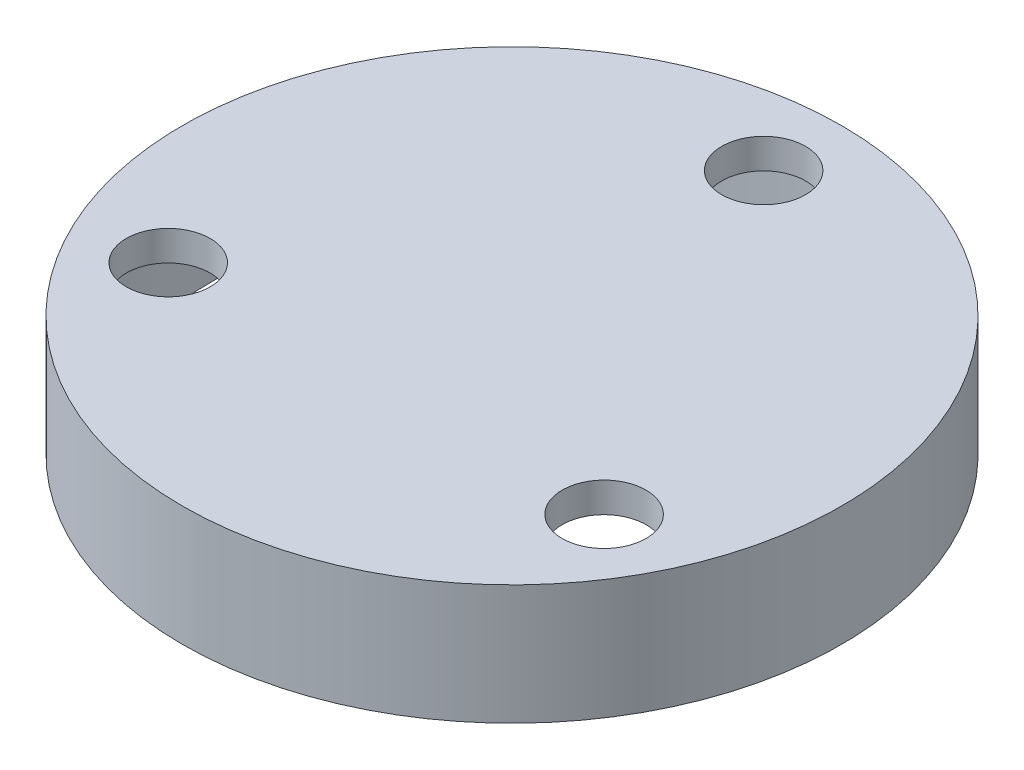
ISO-10303-21;
HEADER;
FILE_DESCRIPTION(('STEP AP214'),'2;1');
FILE_NAME('part.step','',(''),(''),'','','');
FILE_SCHEMA(('AUTOMOTIVE_DESIGN { 1 0 10303 214 1 1 1 1 }'));
ENDSEC;
DATA;
#1=APPLICATION_CONTEXT('core data for automotive mechanical design processes');
#2=APPLICATION_PROTOCOL_DEFINITION('international standard','automotive_design',2000,#1);
#3=PRODUCT_CONTEXT('',#1,'mechanical');
#4=PRODUCT('Part','Part','',(#3));
#5=PRODUCT_RELATED_PRODUCT_CATEGORY('part','',(#4));
#6=PRODUCT_DEFINITION_FORMATION('','',#4);
#7=PRODUCT_DEFINITION_CONTEXT('part definition',#1,'design');
#8=PRODUCT_DEFINITION('design','',#6,#7);
#9=PRODUCT_DEFINITION_SHAPE('','',#8);
#10=(LENGTH_UNIT() NAMED_UNIT(*) SI_UNIT(.MILLI.,.METRE.));
#11=(NAMED_UNIT(*) PLANE_ANGLE_UNIT() SI_UNIT($,.RADIAN.));
#12=(NAMED_UNIT(*) SI_UNIT($,.STERADIAN.) SOLID_ANGLE_UNIT());
#13=UNCERTAINTY_MEASURE_WITH_UNIT(LENGTH_MEASURE(1.E-05),#10,'distance_accuracy_value','');
#14=(GEOMETRIC_REPRESENTATION_CONTEXT(3) GLOBAL_UNCERTAINTY_ASSIGNED_CONTEXT((#13)) GLOBAL_UNIT_ASSIGNED_CONTEXT((#10,
#11,#12)) REPRESENTATION_CONTEXT('',''));
#15=CARTESIAN_POINT('',(0.,0.,0.));
#16=DIRECTION('',(0.,0.,1.));
#17=DIRECTION('',(1.,0.,0.));
#18=AXIS2_PLACEMENT_3D('',#15,#16,#17);
#19=CARTESIAN_POINT('',(0.,20.,0.));
#20=DIRECTION('',(0.,1.,0.));
#21=DIRECTION('',(0.,0.,1.));
#22=AXIS2_PLACEMENT_3D('',#19,#20,#21);
#23=PLANE('',#22);
#24=CARTESIAN_POINT('',(36.3730669589491,20.,20.9999999999985));
#25=DIRECTION('',(0.,1.,0.));
#26=DIRECTION('',(0.,0.,1.));
#27=AXIS2_PLACEMENT_3D('',#24,#25,#26);
#28=CIRCLE('',#27,7.0000000000023);
#29=CARTESIAN_POINT('',(36.3730669589491,20.,28.0000000000008));
#30=VERTEX_POINT('',#29);
#31=EDGE_CURVE('E61',#30,#30,#28,.T.);
#32=ORIENTED_EDGE('',*,*,#31,.F.);
#33=EDGE_LOOP('',(#32));
#34=FACE_BOUND('',#33,.T.);
#35=CARTESIAN_POINT('',(0.,20.,0.));
#36=DIRECTION('',(0.,1.,0.));
#37=DIRECTION('',(0.,0.,1.));
#38=AXIS2_PLACEMENT_3D('',#35,#36,#37);
#39=CIRCLE('',#38,55.);
#40=CARTESIAN_POINT('',(0.,20.,55.));
#41=VERTEX_POINT('',#40);
#42=EDGE_CURVE('E11',#41,#41,#39,.T.);
#43=ORIENTED_EDGE('',*,*,#42,.T.);
#44=EDGE_LOOP('',(#43));
#45=FACE_BOUND('',#44,.T.);
#46=CARTESIAN_POINT('',(0.,20.,-42.));
#47=DIRECTION('',(0.,1.,0.));
#48=DIRECTION('',(0.,0.,1.));
#49=AXIS2_PLACEMENT_3D('',#46,#47,#48);
#50=CIRCLE('',#49,7.);
#51=CARTESIAN_POINT('',(0.,20.,-35.));
#52=VERTEX_POINT('',#51);
#53=EDGE_CURVE('E56',#52,#52,#50,.T.);
#54=ORIENTED_EDGE('',*,*,#53,.F.);
#55=EDGE_LOOP('',(#54));
#56=FACE_BOUND('',#55,.T.);
#57=CARTESIAN_POINT('',(-36.3730669589438,20.,21.0000000000015));
#58=DIRECTION('',(0.,1.,0.));
#59=DIRECTION('',(0.,0.,1.));
#60=AXIS2_PLACEMENT_3D('',#57,#58,#59);
#61=CIRCLE('',#60,7.00000000000337);
#62=CARTESIAN_POINT('',(-36.3730669589438,20.,28.0000000000049));
#63=VERTEX_POINT('',#62);
#64=EDGE_CURVE('E65',#63,#63,#61,.T.);
#65=ORIENTED_EDGE('',*,*,#64,.F.);
#66=EDGE_LOOP('',(#65));
#67=FACE_BOUND('',#66,.T.);
#68=ADVANCED_FACE('F43',(#34,#45,#56,#67),#23,.T.);
#69=CARTESIAN_POINT('',(0.,0.,0.));
#70=DIRECTION('',(0.,1.,0.));
#71=DIRECTION('',(0.,0.,1.));
#72=AXIS2_PLACEMENT_3D('',#69,#70,#71);
#73=PLANE('',#72);
#74=CARTESIAN_POINT('',(0.,0.,0.));
#75=DIRECTION('',(0.,-1.,0.));
#76=DIRECTION('',(0.,0.,-1.));
#77=AXIS2_PLACEMENT_3D('',#74,#75,#76);
#78=CIRCLE('',#77,50.);
#79=CARTESIAN_POINT('',(0.,0.,-50.));
#80=VERTEX_POINT('',#79);
#81=EDGE_CURVE('E69',#80,#80,#78,.T.);
#82=ORIENTED_EDGE('',*,*,#81,.F.);
#83=EDGE_LOOP('',(#82));
#84=FACE_BOUND('',#83,.T.);
#85=CARTESIAN_POINT('',(0.,0.,0.));
#86=DIRECTION('',(0.,1.,0.));
#87=DIRECTION('',(0.,0.,1.));
#88=AXIS2_PLACEMENT_3D('',#85,#86,#87);
#89=CIRCLE('',#88,55.);
#90=CARTESIAN_POINT('',(0.,0.,55.));
#91=VERTEX_POINT('',#90);
#92=EDGE_CURVE('E47',#91,#91,#89,.T.);
#93=ORIENTED_EDGE('',*,*,#92,.F.);
#94=EDGE_LOOP('',(#93));
#95=FACE_BOUND('',#94,.T.);
#96=ADVANCED_FACE('F102',(#84,#95),#73,.F.);
#97=CARTESIAN_POINT('',(0.,20.,0.));
#98=DIRECTION('',(0.,-1.,0.));
#99=DIRECTION('',(0.,0.,-1.));
#100=AXIS2_PLACEMENT_3D('',#97,#98,#99);
#101=CYLINDRICAL_SURFACE('',#100,55.);
#102=ORIENTED_EDGE('',*,*,#42,.F.);
#103=EDGE_LOOP('',(#102));
#104=FACE_BOUND('',#103,.T.);
#105=ORIENTED_EDGE('',*,*,#92,.T.);
#106=EDGE_LOOP('',(#105));
#107=FACE_BOUND('',#106,.T.);
#108=ADVANCED_FACE('F45',(#104,#107),#101,.T.);
#109=CARTESIAN_POINT('',(0.,20.,-42.));
#110=DIRECTION('',(0.,-1.,0.));
#111=DIRECTION('',(0.,0.,-1.));
#112=AXIS2_PLACEMENT_3D('',#109,#110,#111);
#113=CYLINDRICAL_SURFACE('',#112,7.);
#114=CARTESIAN_POINT('',(0.,15.,-42.));
#115=DIRECTION('',(0.,1.,0.));
#116=DIRECTION('',(0.,0.,1.));
#117=AXIS2_PLACEMENT_3D('',#114,#115,#116);
#118=CIRCLE('',#117,7.);
#119=CARTESIAN_POINT('',(0.,15.,-35.));
#120=VERTEX_POINT('',#119);
#121=EDGE_CURVE('E78',#120,#120,#118,.T.);
#122=ORIENTED_EDGE('',*,*,#121,.F.);
#123=EDGE_LOOP('',(#122));
#124=FACE_BOUND('',#123,.T.);
#125=ORIENTED_EDGE('',*,*,#53,.T.);
#126=EDGE_LOOP('',(#125));
#127=FACE_BOUND('',#126,.T.);
#128=ADVANCED_FACE('F97',(#124,#127),#113,.F.);
#129=CARTESIAN_POINT('',(36.3730669589491,20.,20.9999999999985));
#130=DIRECTION('',(0.,-1.,0.));
#131=DIRECTION('',(0.,0.,-1.));
#132=AXIS2_PLACEMENT_3D('',#129,#130,#131);
#133=CYLINDRICAL_SURFACE('',#132,7.0000000000023);
#134=CARTESIAN_POINT('',(36.3730669589491,15.,20.9999999999985));
#135=DIRECTION('',(0.,1.,0.));
#136=DIRECTION('',(0.,0.,1.));
#137=AXIS2_PLACEMENT_3D('',#134,#135,#136);
#138=CIRCLE('',#137,7.0000000000023);
#139=CARTESIAN_POINT('',(36.3730669589491,15.,28.0000000000008));
#140=VERTEX_POINT('',#139);
#141=EDGE_CURVE('E74',#140,#140,#138,.T.);
#142=ORIENTED_EDGE('',*,*,#141,.F.);
#143=EDGE_LOOP('',(#142));
#144=FACE_BOUND('',#143,.T.);
#145=ORIENTED_EDGE('',*,*,#31,.T.);
#146=EDGE_LOOP('',(#145));
#147=FACE_BOUND('',#146,.T.);
#148=ADVANCED_FACE('F93',(#144,#147),#133,.F.);
#149=CARTESIAN_POINT('',(-36.3730669589438,20.,21.0000000000015));
#150=DIRECTION('',(0.,-1.,0.));
#151=DIRECTION('',(0.,0.,-1.));
#152=AXIS2_PLACEMENT_3D('',#149,#150,#151);
#153=CYLINDRICAL_SURFACE('',#152,7.00000000000337);
#154=CARTESIAN_POINT('',(-36.3730669589438,15.,21.0000000000015));
#155=DIRECTION('',(0.,1.,0.));
#156=DIRECTION('',(0.,0.,1.));
#157=AXIS2_PLACEMENT_3D('',#154,#155,#156);
#158=CIRCLE('',#157,7.00000000000337);
#159=CARTESIAN_POINT('',(-36.3730669589438,15.,28.0000000000049));
#160=VERTEX_POINT('',#159);
#161=EDGE_CURVE('E82',#160,#160,#158,.T.);
#162=ORIENTED_EDGE('',*,*,#161,.F.);
#163=EDGE_LOOP('',(#162));
#164=FACE_BOUND('',#163,.T.);
#165=ORIENTED_EDGE('',*,*,#64,.T.);
#166=EDGE_LOOP('',(#165));
#167=FACE_BOUND('',#166,.T.);
#168=ADVANCED_FACE('F96',(#164,#167),#153,.F.);
#169=CARTESIAN_POINT('',(0.,161.42135623731,0.));
#170=DIRECTION('',(0.,-1.,0.));
#171=DIRECTION('',(0.,0.,-1.));
#172=AXIS2_PLACEMENT_3D('',#169,#170,#171);
#173=CYLINDRICAL_SURFACE('',#172,50.);
#174=ORIENTED_EDGE('',*,*,#81,.T.);
#175=EDGE_LOOP('',(#174));
#176=FACE_BOUND('',#175,.T.);
#177=CARTESIAN_POINT('',(0.,15.,0.));
#178=DIRECTION('',(0.,1.,0.));
#179=DIRECTION('',(0.,0.,1.));
#180=AXIS2_PLACEMENT_3D('',#177,#178,#179);
#181=CIRCLE('',#180,50.);
#182=CARTESIAN_POINT('',(0.,15.,50.));
#183=VERTEX_POINT('',#182);
#184=EDGE_CURVE('E70',#183,#183,#181,.F.);
#185=ORIENTED_EDGE('',*,*,#184,.F.);
#186=EDGE_LOOP('',(#185));
#187=FACE_BOUND('',#186,.T.);
#188=ADVANCED_FACE('F110',(#176,#187),#173,.F.);
#189=CARTESIAN_POINT('',(0.,15.,0.));
#190=DIRECTION('',(0.,1.,0.));
#191=DIRECTION('',(0.,0.,1.));
#192=AXIS2_PLACEMENT_3D('',#189,#190,#191);
#193=PLANE('',#192);
#194=ORIENTED_EDGE('',*,*,#121,.T.);
#195=EDGE_LOOP('',(#194));
#196=FACE_BOUND('',#195,.T.);
#197=ORIENTED_EDGE('',*,*,#161,.T.);
#198=EDGE_LOOP('',(#197));
#199=FACE_BOUND('',#198,.T.);
#200=ORIENTED_EDGE('',*,*,#141,.T.);
#201=EDGE_LOOP('',(#200));
#202=FACE_BOUND('',#201,.T.);
#203=ORIENTED_EDGE('',*,*,#184,.T.);
#204=EDGE_LOOP('',(#203));
#205=FACE_BOUND('',#204,.T.);
#206=ADVANCED_FACE('F90',(#196,#199,#202,#205),#193,.F.);
#207=CLOSED_SHELL('',(#68,#96,#108,#128,#148,#168,#188,#206));
#208=MANIFOLD_SOLID_BREP('B2',#207);
#209=ADVANCED_BREP_SHAPE_REPRESENTATION('',(#18,#208),#14);
#210=SHAPE_DEFINITION_REPRESENTATION(#9,#209);
ENDSEC;
END-ISO-10303-21;
